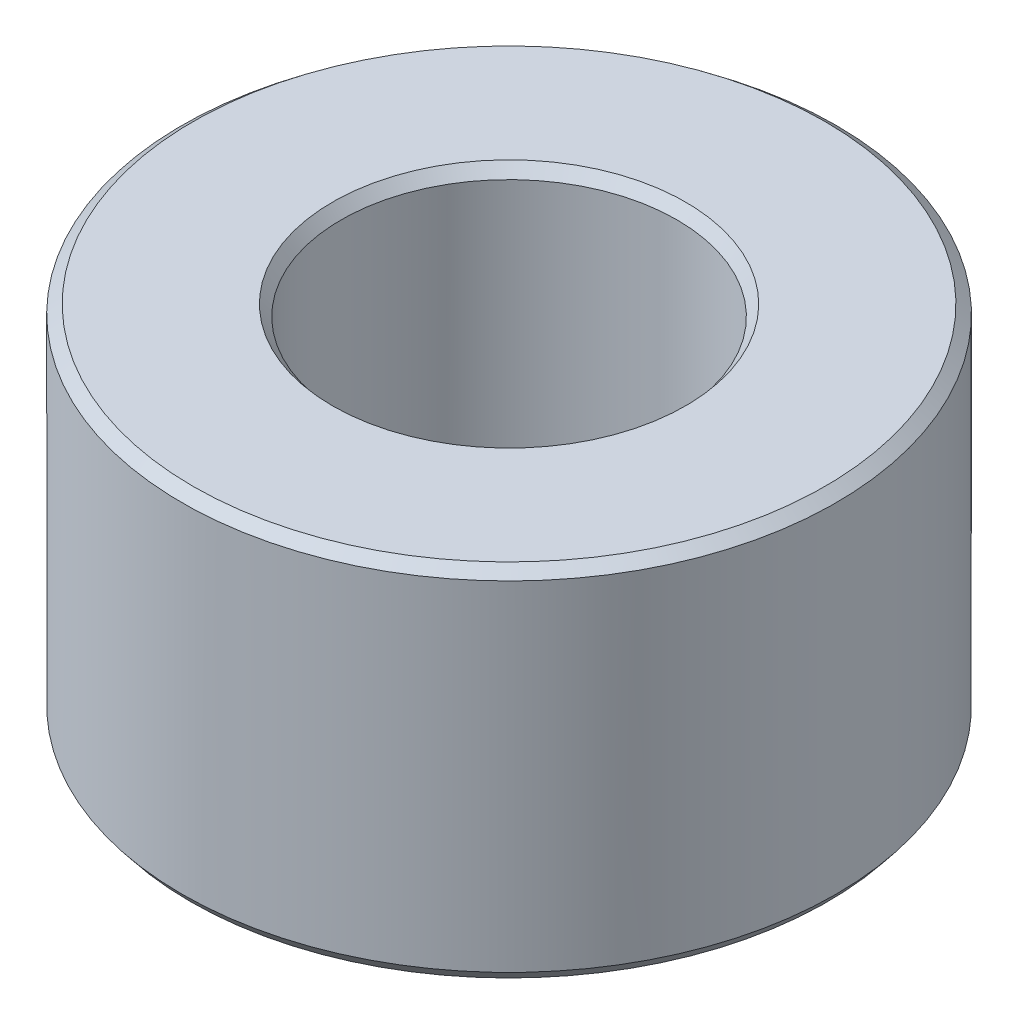
ISO-10303-21;
HEADER;
FILE_DESCRIPTION(('STEP AP214'),'2;1');
FILE_NAME('part.step','',(''),(''),'','','');
FILE_SCHEMA(('AUTOMOTIVE_DESIGN { 1 0 10303 214 1 1 1 1 }'));
ENDSEC;
DATA;
#1=APPLICATION_CONTEXT('core data for automotive mechanical design processes');
#2=APPLICATION_PROTOCOL_DEFINITION('international standard','automotive_design',2000,#1);
#3=PRODUCT_CONTEXT('',#1,'mechanical');
#4=PRODUCT('Part','Part','',(#3));
#5=PRODUCT_RELATED_PRODUCT_CATEGORY('part','',(#4));
#6=PRODUCT_DEFINITION_FORMATION('','',#4);
#7=PRODUCT_DEFINITION_CONTEXT('part definition',#1,'design');
#8=PRODUCT_DEFINITION('design','',#6,#7);
#9=PRODUCT_DEFINITION_SHAPE('','',#8);
#10=(LENGTH_UNIT() NAMED_UNIT(*) SI_UNIT(.MILLI.,.METRE.));
#11=(NAMED_UNIT(*) PLANE_ANGLE_UNIT() SI_UNIT($,.RADIAN.));
#12=(NAMED_UNIT(*) SI_UNIT($,.STERADIAN.) SOLID_ANGLE_UNIT());
#13=UNCERTAINTY_MEASURE_WITH_UNIT(LENGTH_MEASURE(1.E-05),#10,'distance_accuracy_value','');
#14=(GEOMETRIC_REPRESENTATION_CONTEXT(3) GLOBAL_UNCERTAINTY_ASSIGNED_CONTEXT((#13)) GLOBAL_UNIT_ASSIGNED_CONTEXT((#10,
#11,#12)) REPRESENTATION_CONTEXT('',''));
#15=CARTESIAN_POINT('',(0.,0.,0.));
#16=DIRECTION('',(0.,0.,1.));
#17=DIRECTION('',(1.,0.,0.));
#18=AXIS2_PLACEMENT_3D('',#15,#16,#17);
#19=CARTESIAN_POINT('',(0.,46.6252086314588,0.));
#20=DIRECTION('',(0.,-1.,0.));
#21=DIRECTION('',(0.,0.,-1.));
#22=AXIS2_PLACEMENT_3D('',#19,#20,#21);
#23=CYLINDRICAL_SURFACE('',#22,42.5);
#24=CARTESIAN_POINT('',(0.,1.42703970829134,0.));
#25=DIRECTION('',(0.,1.,0.));
#26=DIRECTION('',(0.,0.,1.));
#27=AXIS2_PLACEMENT_3D('',#24,#25,#26);
#28=CIRCLE('',#27,42.5);
#29=CARTESIAN_POINT('',(0.,1.42703970829134,-42.5));
#30=VERTEX_POINT('',#29);
#31=EDGE_CURVE('E10',#30,#30,#28,.T.);
#32=CARTESIAN_POINT('',(0.,45.4927284590016,0.));
#33=DIRECTION('',(0.,1.,0.));
#34=DIRECTION('',(0.,0.,1.));
#35=AXIS2_PLACEMENT_3D('',#32,#33,#34);
#36=CIRCLE('',#35,42.5);
#37=CARTESIAN_POINT('',(0.,45.4927284590016,-42.5));
#38=VERTEX_POINT('',#37);
#39=EDGE_CURVE('E50',#38,#38,#36,.F.);
#40=CARTESIAN_POINT('',(0.,1.42703970829134,-42.5));
#41=CARTESIAN_POINT('',(0.,1.88605729944457,-42.5));
#42=CARTESIAN_POINT('',(0.,2.3450748905978,-42.5));
#43=CARTESIAN_POINT('',(0.,3.26311007290427,-42.5));
#44=CARTESIAN_POINT('',(0.,3.7221276640575,-42.5));
#45=CARTESIAN_POINT('',(0.,4.64016284636397,-42.5));
#46=CARTESIAN_POINT('',(0.,5.0991804375172,-42.5));
#47=CARTESIAN_POINT('',(0.,6.01721561982367,-42.5));
#48=CARTESIAN_POINT('',(0.,6.4762332109769,-42.5));
#49=CARTESIAN_POINT('',(0.,7.39426839328336,-42.5));
#50=CARTESIAN_POINT('',(0.,7.85328598443659,-42.5));
#51=CARTESIAN_POINT('',(0.,8.77132116674306,-42.5));
#52=CARTESIAN_POINT('',(0.,9.23033875789629,-42.5));
#53=CARTESIAN_POINT('',(0.,10.1483739402028,-42.5));
#54=CARTESIAN_POINT('',(0.,10.607391531356,-42.5));
#55=CARTESIAN_POINT('',(0.,11.5254267136625,-42.5));
#56=CARTESIAN_POINT('',(0.,11.9844443048157,-42.5));
#57=CARTESIAN_POINT('',(0.,12.9024794871222,-42.5));
#58=CARTESIAN_POINT('',(0.,13.3614970782754,-42.5));
#59=CARTESIAN_POINT('',(0.,14.2795322605818,-42.5));
#60=CARTESIAN_POINT('',(0.,14.7385498517351,-42.5));
#61=CARTESIAN_POINT('',(0.,15.6565850340415,-42.5));
#62=CARTESIAN_POINT('',(0.,16.1156026251948,-42.5));
#63=CARTESIAN_POINT('',(0.,17.0336378075012,-42.5));
#64=CARTESIAN_POINT('',(0.,17.4926553986545,-42.5));
#65=CARTESIAN_POINT('',(0.,18.4106905809609,-42.5));
#66=CARTESIAN_POINT('',(0.,18.8697081721142,-42.5));
#67=CARTESIAN_POINT('',(0.,19.7877433544206,-42.5));
#68=CARTESIAN_POINT('',(0.,20.2467609455739,-42.5));
#69=CARTESIAN_POINT('',(0.,21.1647961278803,-42.5));
#70=CARTESIAN_POINT('',(0.,21.6238137190336,-42.5));
#71=CARTESIAN_POINT('',(0.,22.54184890134,-42.5));
#72=CARTESIAN_POINT('',(0.,23.0008664924933,-42.5));
#73=CARTESIAN_POINT('',(0.,23.9189016747997,-42.5));
#74=CARTESIAN_POINT('',(0.,24.377919265953,-42.5));
#75=CARTESIAN_POINT('',(0.,25.2959544482594,-42.5));
#76=CARTESIAN_POINT('',(0.,25.7549720394126,-42.5));
#77=CARTESIAN_POINT('',(0.,26.6730072217191,-42.5));
#78=CARTESIAN_POINT('',(0.,27.1320248128723,-42.5));
#79=CARTESIAN_POINT('',(0.,28.0500599951788,-42.5));
#80=CARTESIAN_POINT('',(0.,28.509077586332,-42.5));
#81=CARTESIAN_POINT('',(0.,29.4271127686385,-42.5));
#82=CARTESIAN_POINT('',(0.,29.8861303597917,-42.5));
#83=CARTESIAN_POINT('',(0.,30.8041655420982,-42.5));
#84=CARTESIAN_POINT('',(0.,31.2631831332514,-42.5));
#85=CARTESIAN_POINT('',(0.,32.1812183155579,-42.5));
#86=CARTESIAN_POINT('',(0.,32.6402359067111,-42.5));
#87=CARTESIAN_POINT('',(0.,33.5582710890176,-42.5));
#88=CARTESIAN_POINT('',(0.,34.0172886801708,-42.5));
#89=CARTESIAN_POINT('',(0.,34.9353238624773,-42.5));
#90=CARTESIAN_POINT('',(0.,35.3943414536305,-42.5));
#91=CARTESIAN_POINT('',(0.,36.312376635937,-42.5));
#92=CARTESIAN_POINT('',(0.,36.7713942270902,-42.5));
#93=CARTESIAN_POINT('',(0.,37.6894294093967,-42.5));
#94=CARTESIAN_POINT('',(0.,38.1484470005499,-42.5));
#95=CARTESIAN_POINT('',(0.,39.0664821828564,-42.5));
#96=CARTESIAN_POINT('',(0.,39.5254997740096,-42.5));
#97=CARTESIAN_POINT('',(0.,40.4435349563161,-42.5));
#98=CARTESIAN_POINT('',(0.,40.9025525474693,-42.5));
#99=CARTESIAN_POINT('',(0.,41.8205877297758,-42.5));
#100=CARTESIAN_POINT('',(0.,42.279605320929,-42.5));
#101=CARTESIAN_POINT('',(0.,43.1976405032355,-42.5));
#102=CARTESIAN_POINT('',(0.,43.6566580943887,-42.5));
#103=CARTESIAN_POINT('',(0.,44.5746932766952,-42.5));
#104=CARTESIAN_POINT('',(0.,45.0337108678484,-42.5));
#105=CARTESIAN_POINT('',(0.,45.4927284590016,-42.5));
#106=B_SPLINE_CURVE_WITH_KNOTS('',3,(#40,#41,#42,#43,#44,#45,#46,#47,#48,#49,#50,#51,#52,#53,
#54,#55,#56,#57,#58,#59,#60,#61,#62,#63,#64,#65,#66,#67,#68,#69,#70,#71,#72,#73,#74,#75,#76,#77,
#78,#79,#80,#81,#82,#83,#84,#85,#86,#87,#88,#89,#90,#91,#92,#93,#94,#95,#96,#97,#98,#99,#100,
#101,#102,#103,#104,#105),.UNSPECIFIED.,.F.,.F.,(4,2,2,2,2,2,2,2,2,2,2,2,2,2,2,2,2,2,2,2,2,2,2,
2,2,2,2,2,2,2,2,2,4),(0.,1.3770527734597,2.75410554691939,4.13115832037909,5.50821109383879,
6.88526386729849,8.26231664075818,9.63936941421788,11.0164221876776,12.3934749611373,
13.770527734597,15.1475805080567,16.5246332815164,17.9016860549761,19.2787388284358,
20.6557916018955,22.0328443753552,23.4098971488148,24.7869499222745,26.1640026957342,
27.5410554691939,28.9181082426536,30.2951610161133,31.672213789573,33.0492665630327,
34.4263193364924,35.8033721099521,37.1804248834118,38.5574776568715,39.9345304303312,
41.3115832037909,42.6886359772506,44.0656887507103),.UNSPECIFIED.);
#107=EDGE_CURVE('BSEAM39',#30,#38,#106,.T.);
#108=ORIENTED_EDGE('',*,*,#31,.T.);
#109=ORIENTED_EDGE('',*,*,#39,.T.);
#110=ORIENTED_EDGE('',*,*,#107,.T.);
#111=ORIENTED_EDGE('',*,*,#107,.F.);
#112=EDGE_LOOP('',(#108,#110,#109,#111));
#113=FACE_BOUND('',#112,.T.);
#114=ADVANCED_FACE('F39',(#113),#23,.T.);
#115=CARTESIAN_POINT('',(0.,46.6252086314588,0.));
#116=DIRECTION('',(0.,1.,0.));
#117=DIRECTION('',(0.,0.,1.));
#118=AXIS2_PLACEMENT_3D('',#115,#116,#117);
#119=PLANE('',#118);
#120=CARTESIAN_POINT('',(0.,46.6252086314588,0.));
#121=DIRECTION('',(0.,1.,0.));
#122=DIRECTION('',(0.,0.,1.));
#123=AXIS2_PLACEMENT_3D('',#120,#121,#122);
#124=CIRCLE('',#123,22.9492635567781);
#125=CARTESIAN_POINT('',(0.,46.6252086314588,22.9492635567781));
#126=VERTEX_POINT('',#125);
#127=EDGE_CURVE('E58',#126,#126,#124,.F.);
#128=ORIENTED_EDGE('',*,*,#127,.T.);
#129=EDGE_LOOP('',(#128));
#130=FACE_BOUND('',#129,.T.);
#131=CARTESIAN_POINT('',(0.,46.6252086314588,0.));
#132=DIRECTION('',(0.,1.,0.));
#133=DIRECTION('',(0.,0.,1.));
#134=AXIS2_PLACEMENT_3D('',#131,#132,#133);
#135=CIRCLE('',#134,41.0729602917089);
#136=CARTESIAN_POINT('',(0.,46.6252086314588,41.0729602917089));
#137=VERTEX_POINT('',#136);
#138=EDGE_CURVE('E61',#137,#137,#135,.T.);
#139=ORIENTED_EDGE('',*,*,#138,.T.);
#140=EDGE_LOOP('',(#139));
#141=FACE_BOUND('',#140,.T.);
#142=ADVANCED_FACE('F88',(#130,#141),#119,.T.);
#143=CARTESIAN_POINT('',(0.,0.,0.));
#144=DIRECTION('',(0.,1.,0.));
#145=DIRECTION('',(0.,0.,1.));
#146=AXIS2_PLACEMENT_3D('',#143,#144,#145);
#147=PLANE('',#146);
#148=CARTESIAN_POINT('',(0.,0.,0.));
#149=DIRECTION('',(0.,1.,0.));
#150=DIRECTION('',(0.,0.,1.));
#151=AXIS2_PLACEMENT_3D('',#148,#149,#150);
#152=CIRCLE('',#151,23.243823092612);
#153=CARTESIAN_POINT('',(0.,0.,23.243823092612));
#154=VERTEX_POINT('',#153);
#155=EDGE_CURVE('E51',#154,#154,#152,.T.);
#156=ORIENTED_EDGE('',*,*,#155,.T.);
#157=EDGE_LOOP('',(#156));
#158=FACE_BOUND('',#157,.T.);
#159=CARTESIAN_POINT('',(0.,0.,0.));
#160=DIRECTION('',(0.,1.,0.));
#161=DIRECTION('',(0.,0.,1.));
#162=AXIS2_PLACEMENT_3D('',#159,#160,#161);
#163=CIRCLE('',#162,41.3675198275427);
#164=CARTESIAN_POINT('',(0.,0.,41.3675198275427));
#165=VERTEX_POINT('',#164);
#166=EDGE_CURVE('E54',#165,#165,#163,.F.);
#167=ORIENTED_EDGE('',*,*,#166,.T.);
#168=EDGE_LOOP('',(#167));
#169=FACE_BOUND('',#168,.T.);
#170=ADVANCED_FACE('F83',(#158,#169),#147,.F.);
#171=CARTESIAN_POINT('',(0.,46.6252086314588,0.));
#172=DIRECTION('',(0.,-1.,0.));
#173=DIRECTION('',(0.,0.,-1.));
#174=AXIS2_PLACEMENT_3D('',#171,#172,#173);
#175=CYLINDRICAL_SURFACE('',#174,21.8167833843209);
#176=CARTESIAN_POINT('',(0.,45.1981689231676,0.));
#177=DIRECTION('',(0.,1.,0.));
#178=DIRECTION('',(0.,0.,1.));
#179=AXIS2_PLACEMENT_3D('',#176,#177,#178);
#180=CIRCLE('',#179,21.8167833843209);
#181=CARTESIAN_POINT('',(0.,45.1981689231676,-21.8167833843209));
#182=VERTEX_POINT('',#181);
#183=EDGE_CURVE('E67',#182,#182,#180,.T.);
#184=CARTESIAN_POINT('',(0.,1.13248017245722,0.));
#185=DIRECTION('',(0.,1.,0.));
#186=DIRECTION('',(0.,0.,1.));
#187=AXIS2_PLACEMENT_3D('',#184,#185,#186);
#188=CIRCLE('',#187,21.8167833843209);
#189=CARTESIAN_POINT('',(0.,1.13248017245721,-21.8167833843209));
#190=VERTEX_POINT('',#189);
#191=EDGE_CURVE('E69',#190,#190,#188,.F.);
#192=CARTESIAN_POINT('',(0.,45.1981689231676,-21.8167833843209));
#193=CARTESIAN_POINT('',(0.,44.7391513320144,-21.8167833843209));
#194=CARTESIAN_POINT('',(0.,44.2801337408611,-21.8167833843209));
#195=CARTESIAN_POINT('',(0.,43.3620985585547,-21.8167833843209));
#196=CARTESIAN_POINT('',(0.,42.9030809674014,-21.8167833843209));
#197=CARTESIAN_POINT('',(0.,41.985045785095,-21.8167833843209));
#198=CARTESIAN_POINT('',(0.,41.5260281939417,-21.8167833843209));
#199=CARTESIAN_POINT('',(0.,40.6079930116353,-21.8167833843209));
#200=CARTESIAN_POINT('',(0.,40.148975420482,-21.8167833843209));
#201=CARTESIAN_POINT('',(0.,39.2309402381756,-21.8167833843209));
#202=CARTESIAN_POINT('',(0.,38.7719226470223,-21.8167833843209));
#203=CARTESIAN_POINT('',(0.,37.8538874647159,-21.8167833843209));
#204=CARTESIAN_POINT('',(0.,37.3948698735626,-21.8167833843209));
#205=CARTESIAN_POINT('',(0.,36.4768346912562,-21.8167833843209));
#206=CARTESIAN_POINT('',(0.,36.0178171001029,-21.8167833843209));
#207=CARTESIAN_POINT('',(0.,35.0997819177965,-21.8167833843209));
#208=CARTESIAN_POINT('',(0.,34.6407643266432,-21.8167833843209));
#209=CARTESIAN_POINT('',(0.,33.7227291443368,-21.8167833843209));
#210=CARTESIAN_POINT('',(0.,33.2637115531835,-21.8167833843209));
#211=CARTESIAN_POINT('',(0.,32.3456763708771,-21.8167833843209));
#212=CARTESIAN_POINT('',(0.,31.8866587797238,-21.8167833843209));
#213=CARTESIAN_POINT('',(0.,30.9686235974174,-21.8167833843209));
#214=CARTESIAN_POINT('',(0.,30.5096060062641,-21.8167833843209));
#215=CARTESIAN_POINT('',(0.,29.5915708239577,-21.8167833843209));
#216=CARTESIAN_POINT('',(0.,29.1325532328044,-21.8167833843209));
#217=CARTESIAN_POINT('',(0.,28.214518050498,-21.8167833843209));
#218=CARTESIAN_POINT('',(0.,27.7555004593447,-21.8167833843209));
#219=CARTESIAN_POINT('',(0.,26.8374652770383,-21.8167833843209));
#220=CARTESIAN_POINT('',(0.,26.378447685885,-21.8167833843209));
#221=CARTESIAN_POINT('',(0.,25.4604125035786,-21.8167833843209));
#222=CARTESIAN_POINT('',(0.,25.0013949124253,-21.8167833843209));
#223=CARTESIAN_POINT('',(0.,24.0833597301189,-21.8167833843209));
#224=CARTESIAN_POINT('',(0.,23.6243421389656,-21.8167833843209));
#225=CARTESIAN_POINT('',(0.,22.7063069566592,-21.8167833843209));
#226=CARTESIAN_POINT('',(0.,22.2472893655059,-21.8167833843209));
#227=CARTESIAN_POINT('',(0.,21.3292541831995,-21.8167833843209));
#228=CARTESIAN_POINT('',(0.,20.8702365920462,-21.8167833843209));
#229=CARTESIAN_POINT('',(0.,19.9522014097398,-21.8167833843209));
#230=CARTESIAN_POINT('',(0.,19.4931838185865,-21.8167833843209));
#231=CARTESIAN_POINT('',(0.,18.5751486362801,-21.8167833843209));
#232=CARTESIAN_POINT('',(0.,18.1161310451268,-21.8167833843209));
#233=CARTESIAN_POINT('',(0.,17.1980958628204,-21.8167833843209));
#234=CARTESIAN_POINT('',(0.,16.7390782716671,-21.8167833843209));
#235=CARTESIAN_POINT('',(0.,15.8210430893607,-21.8167833843209));
#236=CARTESIAN_POINT('',(0.,15.3620254982074,-21.8167833843209));
#237=CARTESIAN_POINT('',(0.,14.443990315901,-21.8167833843209));
#238=CARTESIAN_POINT('',(0.,13.9849727247477,-21.8167833843209));
#239=CARTESIAN_POINT('',(0.,13.0669375424413,-21.8167833843209));
#240=CARTESIAN_POINT('',(0.,12.607919951288,-21.8167833843209));
#241=CARTESIAN_POINT('',(0.,11.6898847689816,-21.8167833843209));
#242=CARTESIAN_POINT('',(0.,11.2308671778283,-21.8167833843209));
#243=CARTESIAN_POINT('',(0.,10.3128319955219,-21.8167833843209));
#244=CARTESIAN_POINT('',(0.,9.85381440436864,-21.8167833843209));
#245=CARTESIAN_POINT('',(0.,8.93577922206218,-21.8167833843209));
#246=CARTESIAN_POINT('',(0.,8.47676163090894,-21.8167833843209));
#247=CARTESIAN_POINT('',(0.,7.55872644860248,-21.8167833843209));
#248=CARTESIAN_POINT('',(0.,7.09970885744924,-21.8167833843209));
#249=CARTESIAN_POINT('',(0.,6.18167367514278,-21.8167833843209));
#250=CARTESIAN_POINT('',(0.,5.72265608398955,-21.8167833843209));
#251=CARTESIAN_POINT('',(0.,4.80462090168308,-21.8167833843209));
#252=CARTESIAN_POINT('',(0.,4.34560331052985,-21.8167833843209));
#253=CARTESIAN_POINT('',(0.,3.42756812822338,-21.8167833843209));
#254=CARTESIAN_POINT('',(0.,2.96855053707015,-21.8167833843209));
#255=CARTESIAN_POINT('',(0.,2.05051535476368,-21.8167833843209));
#256=CARTESIAN_POINT('',(0.,1.59149776361045,-21.8167833843209));
#257=CARTESIAN_POINT('',(0.,1.13248017245721,-21.8167833843209));
#258=B_SPLINE_CURVE_WITH_KNOTS('',3,(#192,#193,#194,#195,#196,#197,#198,#199,#200,#201,#202,
#203,#204,#205,#206,#207,#208,#209,#210,#211,#212,#213,#214,#215,#216,#217,#218,#219,#220,#221,
#222,#223,#224,#225,#226,#227,#228,#229,#230,#231,#232,#233,#234,#235,#236,#237,#238,#239,#240,
#241,#242,#243,#244,#245,#246,#247,#248,#249,#250,#251,#252,#253,#254,#255,#256,#257),
.UNSPECIFIED.,.F.,.F.,(4,2,2,2,2,2,2,2,2,2,2,2,2,2,2,2,2,2,2,2,2,2,2,2,2,2,2,2,2,2,2,2,4),(0.,
1.3770527734597,2.7541055469194,4.13115832037909,5.5082110938388,6.88526386729849,
8.2623166407582,9.63936941421789,11.0164221876776,12.3934749611373,13.770527734597,
15.1475805080567,16.5246332815164,17.9016860549761,19.2787388284358,20.6557916018955,
22.0328443753552,23.4098971488149,24.7869499222746,26.1640026957343,27.541055469194,
28.9181082426537,30.2951610161134,31.6722137895731,33.0492665630328,34.4263193364925,
35.8033721099522,37.1804248834119,38.5574776568716,39.9345304303313,41.311583203791,
42.6886359772507,44.0656887507104),.UNSPECIFIED.);
#259=EDGE_CURVE('BSEAM71',#182,#190,#258,.T.);
#260=ORIENTED_EDGE('',*,*,#183,.T.);
#261=ORIENTED_EDGE('',*,*,#191,.T.);
#262=ORIENTED_EDGE('',*,*,#259,.T.);
#263=ORIENTED_EDGE('',*,*,#259,.F.);
#264=EDGE_LOOP('',(#260,#262,#261,#263));
#265=FACE_BOUND('',#264,.T.);
#266=ADVANCED_FACE('F71',(#265),#175,.F.);
#267=CARTESIAN_POINT('',(0.,45.1981689231676,0.));
#268=DIRECTION('',(0.,1.,0.));
#269=DIRECTION('',(0.,0.,1.));
#270=AXIS2_PLACEMENT_3D('',#267,#268,#269);
#271=CONICAL_SURFACE('',#270,21.8167833843209,0.670818330265616);
#272=ORIENTED_EDGE('',*,*,#127,.F.);
#273=EDGE_LOOP('',(#272));
#274=FACE_BOUND('',#273,.T.);
#275=ORIENTED_EDGE('',*,*,#183,.F.);
#276=EDGE_LOOP('',(#275));
#277=FACE_BOUND('',#276,.T.);
#278=ADVANCED_FACE('F77',(#274,#277),#271,.F.);
#279=CARTESIAN_POINT('',(0.,0.,0.));
#280=DIRECTION('',(0.,-1.,0.));
#281=DIRECTION('',(0.,0.,-1.));
#282=AXIS2_PLACEMENT_3D('',#279,#280,#281);
#283=CONICAL_SURFACE('',#282,23.243823092612,0.899977996529286);
#284=ORIENTED_EDGE('',*,*,#191,.F.);
#285=EDGE_LOOP('',(#284));
#286=FACE_BOUND('',#285,.T.);
#287=ORIENTED_EDGE('',*,*,#155,.F.);
#288=EDGE_LOOP('',(#287));
#289=FACE_BOUND('',#288,.T.);
#290=ADVANCED_FACE('F73',(#286,#289),#283,.F.);
#291=CARTESIAN_POINT('',(0.,1.42703970829134,0.));
#292=DIRECTION('',(0.,1.,0.));
#293=DIRECTION('',(0.,0.,1.));
#294=AXIS2_PLACEMENT_3D('',#291,#292,#293);
#295=CONICAL_SURFACE('',#294,42.5,0.670818330265605);
#296=ORIENTED_EDGE('',*,*,#166,.F.);
#297=EDGE_LOOP('',(#296));
#298=FACE_BOUND('',#297,.T.);
#299=ORIENTED_EDGE('',*,*,#31,.F.);
#300=EDGE_LOOP('',(#299));
#301=FACE_BOUND('',#300,.T.);
#302=ADVANCED_FACE('F76',(#298,#301),#295,.T.);
#303=CARTESIAN_POINT('',(0.,46.6252086314588,0.));
#304=DIRECTION('',(0.,-1.,0.));
#305=DIRECTION('',(0.,0.,-1.));
#306=AXIS2_PLACEMENT_3D('',#303,#304,#305);
#307=CONICAL_SURFACE('',#306,41.0729602917089,0.899977996529285);
#308=ORIENTED_EDGE('',*,*,#39,.F.);
#309=EDGE_LOOP('',(#308));
#310=FACE_BOUND('',#309,.T.);
#311=ORIENTED_EDGE('',*,*,#138,.F.);
#312=EDGE_LOOP('',(#311));
#313=FACE_BOUND('',#312,.T.);
#314=ADVANCED_FACE('F45',(#310,#313),#307,.T.);
#315=CLOSED_SHELL('',(#114,#142,#170,#266,#278,#290,#302,#314));
#316=MANIFOLD_SOLID_BREP('B2',#315);
#317=ADVANCED_BREP_SHAPE_REPRESENTATION('',(#18,#316),#14);
#318=SHAPE_DEFINITION_REPRESENTATION(#9,#317);
ENDSEC;
END-ISO-10303-21;
